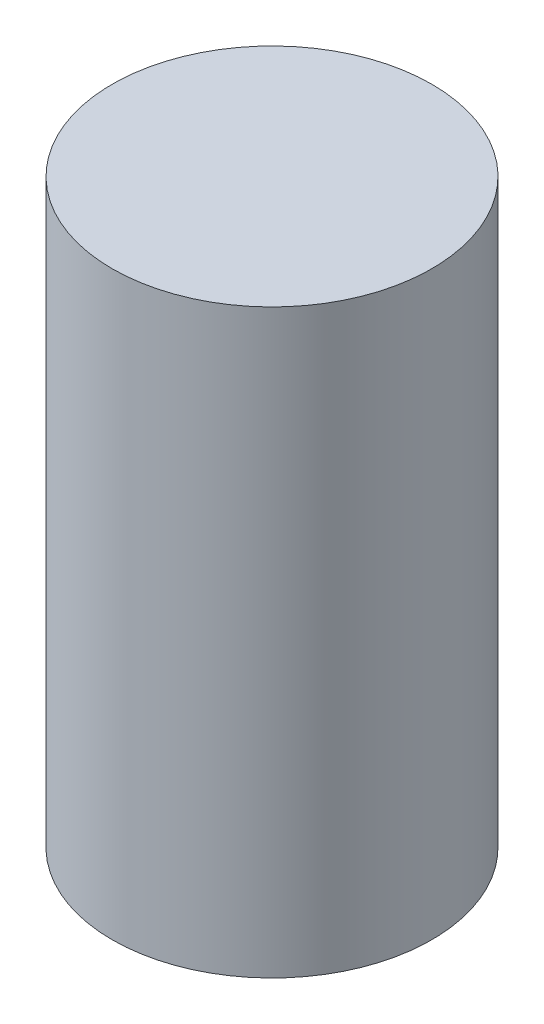
ISO-10303-21;
HEADER;
FILE_DESCRIPTION(('STEP AP214'),'2;1');
FILE_NAME('part.step','',(''),(''),'','','');
FILE_SCHEMA(('AUTOMOTIVE_DESIGN { 1 0 10303 214 1 1 1 1 }'));
ENDSEC;
DATA;
#1=APPLICATION_CONTEXT('core data for automotive mechanical design processes');
#2=APPLICATION_PROTOCOL_DEFINITION('international standard','automotive_design',2000,#1);
#3=PRODUCT_CONTEXT('',#1,'mechanical');
#4=PRODUCT('Part','Part','',(#3));
#5=PRODUCT_RELATED_PRODUCT_CATEGORY('part','',(#4));
#6=PRODUCT_DEFINITION_FORMATION('','',#4);
#7=PRODUCT_DEFINITION_CONTEXT('part definition',#1,'design');
#8=PRODUCT_DEFINITION('design','',#6,#7);
#9=PRODUCT_DEFINITION_SHAPE('','',#8);
#10=(LENGTH_UNIT() NAMED_UNIT(*) SI_UNIT(.MILLI.,.METRE.));
#11=(NAMED_UNIT(*) PLANE_ANGLE_UNIT() SI_UNIT($,.RADIAN.));
#12=(NAMED_UNIT(*) SI_UNIT($,.STERADIAN.) SOLID_ANGLE_UNIT());
#13=UNCERTAINTY_MEASURE_WITH_UNIT(LENGTH_MEASURE(1.E-05),#10,'distance_accuracy_value','');
#14=(GEOMETRIC_REPRESENTATION_CONTEXT(3) GLOBAL_UNCERTAINTY_ASSIGNED_CONTEXT((#13)) GLOBAL_UNIT_ASSIGNED_CONTEXT((#10,
#11,#12)) REPRESENTATION_CONTEXT('',''));
#15=CARTESIAN_POINT('',(0.,0.,0.));
#16=DIRECTION('',(0.,0.,1.));
#17=DIRECTION('',(1.,0.,0.));
#18=AXIS2_PLACEMENT_3D('',#15,#16,#17);
#19=CARTESIAN_POINT('',(0.,254.,0.));
#20=DIRECTION('',(0.,-1.,0.));
#21=DIRECTION('',(0.,0.,-1.));
#22=AXIS2_PLACEMENT_3D('',#19,#20,#21);
#23=CYLINDRICAL_SURFACE('',#22,69.85);
#24=CARTESIAN_POINT('',(0.,254.,0.));
#25=DIRECTION('',(0.,1.,0.));
#26=DIRECTION('',(0.,0.,1.));
#27=AXIS2_PLACEMENT_3D('',#24,#25,#26);
#28=CIRCLE('',#27,69.85);
#29=CARTESIAN_POINT('',(0.,254.,69.85));
#30=VERTEX_POINT('',#29);
#31=EDGE_CURVE('E10',#30,#30,#28,.T.);
#32=ORIENTED_EDGE('',*,*,#31,.F.);
#33=EDGE_LOOP('',(#32));
#34=FACE_BOUND('',#33,.T.);
#35=CARTESIAN_POINT('',(0.,0.,0.));
#36=DIRECTION('',(0.,1.,0.));
#37=DIRECTION('',(0.,0.,1.));
#38=AXIS2_PLACEMENT_3D('',#35,#36,#37);
#39=CIRCLE('',#38,69.85);
#40=CARTESIAN_POINT('',(0.,0.,69.85));
#41=VERTEX_POINT('',#40);
#42=EDGE_CURVE('E38',#41,#41,#39,.T.);
#43=ORIENTED_EDGE('',*,*,#42,.T.);
#44=EDGE_LOOP('',(#43));
#45=FACE_BOUND('',#44,.T.);
#46=ADVANCED_FACE('F35',(#34,#45),#23,.T.);
#47=CARTESIAN_POINT('',(0.,254.,0.));
#48=DIRECTION('',(0.,1.,0.));
#49=DIRECTION('',(0.,0.,1.));
#50=AXIS2_PLACEMENT_3D('',#47,#48,#49);
#51=PLANE('',#50);
#52=ORIENTED_EDGE('',*,*,#31,.T.);
#53=EDGE_LOOP('',(#52));
#54=FACE_BOUND('',#53,.T.);
#55=ADVANCED_FACE('F50',(#54),#51,.T.);
#56=CARTESIAN_POINT('',(0.,0.,0.));
#57=DIRECTION('',(0.,1.,0.));
#58=DIRECTION('',(0.,0.,1.));
#59=AXIS2_PLACEMENT_3D('',#56,#57,#58);
#60=PLANE('',#59);
#61=ORIENTED_EDGE('',*,*,#42,.F.);
#62=EDGE_LOOP('',(#61));
#63=FACE_BOUND('',#62,.T.);
#64=ADVANCED_FACE('F48',(#63),#60,.F.);
#65=CLOSED_SHELL('',(#46,#55,#64));
#66=MANIFOLD_SOLID_BREP('B2',#65);
#67=ADVANCED_BREP_SHAPE_REPRESENTATION('',(#18,#66),#14);
#68=SHAPE_DEFINITION_REPRESENTATION(#9,#67);
ENDSEC;
END-ISO-10303-21;
